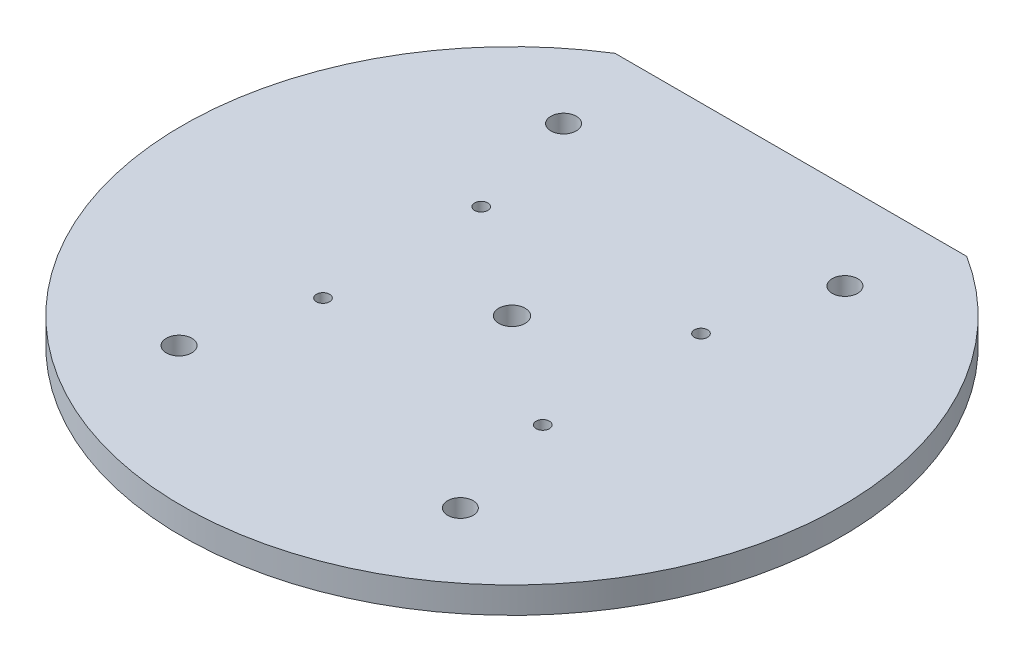
ISO-10303-21;
HEADER;
FILE_DESCRIPTION(('STEP AP214'),'2;1');
FILE_NAME('part.step','',(''),(''),'','','');
FILE_SCHEMA(('AUTOMOTIVE_DESIGN { 1 0 10303 214 1 1 1 1 }'));
ENDSEC;
DATA;
#1=APPLICATION_CONTEXT('core data for automotive mechanical design processes');
#2=APPLICATION_PROTOCOL_DEFINITION('international standard','automotive_design',2000,#1);
#3=PRODUCT_CONTEXT('',#1,'mechanical');
#4=PRODUCT('Part','Part','',(#3));
#5=PRODUCT_RELATED_PRODUCT_CATEGORY('part','',(#4));
#6=PRODUCT_DEFINITION_FORMATION('','',#4);
#7=PRODUCT_DEFINITION_CONTEXT('part definition',#1,'design');
#8=PRODUCT_DEFINITION('design','',#6,#7);
#9=PRODUCT_DEFINITION_SHAPE('','',#8);
#10=(LENGTH_UNIT() NAMED_UNIT(*) SI_UNIT(.MILLI.,.METRE.));
#11=(NAMED_UNIT(*) PLANE_ANGLE_UNIT() SI_UNIT($,.RADIAN.));
#12=(NAMED_UNIT(*) SI_UNIT($,.STERADIAN.) SOLID_ANGLE_UNIT());
#13=UNCERTAINTY_MEASURE_WITH_UNIT(LENGTH_MEASURE(1.E-05),#10,'distance_accuracy_value','');
#14=(GEOMETRIC_REPRESENTATION_CONTEXT(3) GLOBAL_UNCERTAINTY_ASSIGNED_CONTEXT((#13)) GLOBAL_UNIT_ASSIGNED_CONTEXT((#10,
#11,#12)) REPRESENTATION_CONTEXT('',''));
#15=CARTESIAN_POINT('',(0.,0.,0.));
#16=DIRECTION('',(0.,0.,1.));
#17=DIRECTION('',(1.,0.,0.));
#18=AXIS2_PLACEMENT_3D('',#15,#16,#17);
#19=CARTESIAN_POINT('',(0.,6.,0.));
#20=DIRECTION('',(0.,-1.,0.));
#21=DIRECTION('',(0.,0.,-1.));
#22=AXIS2_PLACEMENT_3D('',#19,#20,#21);
#23=CYLINDRICAL_SURFACE('',#22,75.);
#24=CARTESIAN_POINT('',(0.,6.,0.));
#25=DIRECTION('',(0.,1.,0.));
#26=DIRECTION('',(0.,0.,1.));
#27=AXIS2_PLACEMENT_3D('',#24,#25,#26);
#28=CIRCLE('',#27,75.);
#29=CARTESIAN_POINT('',(-40.,6.,-63.4428877022476));
#30=VERTEX_POINT('',#29);
#31=CARTESIAN_POINT('',(40.,6.,-63.4428877022476));
#32=VERTEX_POINT('',#31);
#33=EDGE_CURVE('E11',#30,#32,#28,.T.);
#34=ORIENTED_EDGE('',*,*,#33,.F.);
#35=DIRECTION('',(0.,1.,0.));
#36=VECTOR('',#35,1.);
#37=CARTESIAN_POINT('',(-40.,0.,-63.4428877022476));
#38=LINE('',#37,#36);
#39=CARTESIAN_POINT('',(-40.,0.,-63.4428877022476));
#40=VERTEX_POINT('',#39);
#41=EDGE_CURVE('E59',#40,#30,#38,.T.);
#42=ORIENTED_EDGE('',*,*,#41,.F.);
#43=CARTESIAN_POINT('',(0.,0.,0.));
#44=DIRECTION('',(0.,1.,0.));
#45=DIRECTION('',(0.,0.,1.));
#46=AXIS2_PLACEMENT_3D('',#43,#44,#45);
#47=CIRCLE('',#46,75.);
#48=CARTESIAN_POINT('',(40.,0.,-63.4428877022476));
#49=VERTEX_POINT('',#48);
#50=EDGE_CURVE('E39',#40,#49,#47,.T.);
#51=ORIENTED_EDGE('',*,*,#50,.T.);
#52=DIRECTION('',(0.,1.,0.));
#53=VECTOR('',#52,1.);
#54=CARTESIAN_POINT('',(40.,0.,-63.4428877022476));
#55=LINE('',#54,#53);
#56=EDGE_CURVE('E50',#49,#32,#55,.T.);
#57=ORIENTED_EDGE('',*,*,#56,.T.);
#58=EDGE_LOOP('',(#34,#42,#51,#57));
#59=FACE_BOUND('',#58,.T.);
#60=ADVANCED_FACE('F36',(#59),#23,.T.);
#61=CARTESIAN_POINT('',(0.,6.,0.));
#62=DIRECTION('',(0.,1.,0.));
#63=DIRECTION('',(0.,0.,1.));
#64=AXIS2_PLACEMENT_3D('',#61,#62,#63);
#65=PLANE('',#64);
#66=CARTESIAN_POINT('',(-25.0000000000001,6.,18.));
#67=DIRECTION('',(0.,1.,0.));
#68=DIRECTION('',(0.,0.,1.));
#69=AXIS2_PLACEMENT_3D('',#66,#67,#68);
#70=CIRCLE('',#69,1.49999999999998);
#71=CARTESIAN_POINT('',(-25.0000000000001,6.,19.5));
#72=VERTEX_POINT('',#71);
#73=EDGE_CURVE('E164',#72,#72,#70,.T.);
#74=ORIENTED_EDGE('',*,*,#73,.F.);
#75=EDGE_LOOP('',(#74));
#76=FACE_BOUND('',#75,.T.);
#77=CARTESIAN_POINT('',(-25.,6.,-18.));
#78=DIRECTION('',(0.,1.,0.));
#79=DIRECTION('',(0.,0.,-1.));
#80=AXIS2_PLACEMENT_3D('',#77,#78,#79);
#81=CIRCLE('',#80,1.5);
#82=CARTESIAN_POINT('',(-25.,6.,-19.5));
#83=VERTEX_POINT('',#82);
#84=EDGE_CURVE('E181',#83,#83,#81,.T.);
#85=ORIENTED_EDGE('',*,*,#84,.F.);
#86=EDGE_LOOP('',(#85));
#87=FACE_BOUND('',#86,.T.);
#88=CARTESIAN_POINT('',(25.,6.,-18.));
#89=DIRECTION('',(0.,1.,0.));
#90=DIRECTION('',(0.,0.,1.));
#91=AXIS2_PLACEMENT_3D('',#88,#89,#90);
#92=CIRCLE('',#91,1.5);
#93=CARTESIAN_POINT('',(25.,6.,-16.5));
#94=VERTEX_POINT('',#93);
#95=EDGE_CURVE('E175',#94,#94,#92,.T.);
#96=ORIENTED_EDGE('',*,*,#95,.F.);
#97=EDGE_LOOP('',(#96));
#98=FACE_BOUND('',#97,.T.);
#99=CARTESIAN_POINT('',(31.9999999999999,6.,43.7428877022476));
#100=DIRECTION('',(0.,1.,0.));
#101=DIRECTION('',(0.,0.,1.));
#102=AXIS2_PLACEMENT_3D('',#99,#100,#101);
#103=CIRCLE('',#102,2.9);
#104=CARTESIAN_POINT('',(31.9999999999999,6.,46.6428877022476));
#105=VERTEX_POINT('',#104);
#106=EDGE_CURVE('E169',#105,#105,#103,.T.);
#107=ORIENTED_EDGE('',*,*,#106,.F.);
#108=EDGE_LOOP('',(#107));
#109=FACE_BOUND('',#108,.T.);
#110=CARTESIAN_POINT('',(-32.,6.,43.7428877022476));
#111=DIRECTION('',(0.,1.,0.));
#112=DIRECTION('',(0.,0.,-1.));
#113=AXIS2_PLACEMENT_3D('',#110,#111,#112);
#114=CIRCLE('',#113,2.9);
#115=CARTESIAN_POINT('',(-32.,6.,40.8428877022476));
#116=VERTEX_POINT('',#115);
#117=EDGE_CURVE('E94',#116,#116,#114,.T.);
#118=ORIENTED_EDGE('',*,*,#117,.F.);
#119=EDGE_LOOP('',(#118));
#120=FACE_BOUND('',#119,.T.);
#121=CARTESIAN_POINT('',(0.,6.,0.));
#122=DIRECTION('',(0.,1.,0.));
#123=DIRECTION('',(0.,0.,1.));
#124=AXIS2_PLACEMENT_3D('',#121,#122,#123);
#125=CIRCLE('',#124,3.);
#126=CARTESIAN_POINT('',(0.,6.,3.));
#127=VERTEX_POINT('',#126);
#128=EDGE_CURVE('E88',#127,#127,#125,.T.);
#129=ORIENTED_EDGE('',*,*,#128,.F.);
#130=EDGE_LOOP('',(#129));
#131=FACE_BOUND('',#130,.T.);
#132=CARTESIAN_POINT('',(32.,6.,-43.7428877022476));
#133=DIRECTION('',(0.,1.,0.));
#134=DIRECTION('',(0.,0.,-1.));
#135=AXIS2_PLACEMENT_3D('',#132,#133,#134);
#136=CIRCLE('',#135,2.9);
#137=CARTESIAN_POINT('',(32.,6.,-46.6428877022476));
#138=VERTEX_POINT('',#137);
#139=EDGE_CURVE('E82',#138,#138,#136,.T.);
#140=ORIENTED_EDGE('',*,*,#139,.F.);
#141=EDGE_LOOP('',(#140));
#142=FACE_BOUND('',#141,.T.);
#143=DIRECTION('',(1.,0.,0.));
#144=VECTOR('',#143,1.);
#145=CARTESIAN_POINT('',(-40.,6.,-63.4428877022476));
#146=LINE('',#145,#144);
#147=EDGE_CURVE('E62',#30,#32,#146,.T.);
#148=ORIENTED_EDGE('',*,*,#147,.F.);
#149=ORIENTED_EDGE('',*,*,#33,.T.);
#150=EDGE_LOOP('',(#148,#149));
#151=FACE_BOUND('',#150,.T.);
#152=CARTESIAN_POINT('',(25.,6.,18.));
#153=DIRECTION('',(0.,1.,0.));
#154=DIRECTION('',(0.,0.,-1.));
#155=AXIS2_PLACEMENT_3D('',#152,#153,#154);
#156=CIRCLE('',#155,1.5);
#157=CARTESIAN_POINT('',(25.,6.,16.5));
#158=VERTEX_POINT('',#157);
#159=EDGE_CURVE('E162',#158,#158,#156,.T.);
#160=ORIENTED_EDGE('',*,*,#159,.F.);
#161=EDGE_LOOP('',(#160));
#162=FACE_BOUND('',#161,.T.);
#163=CARTESIAN_POINT('',(-32.,6.,-43.7428877022476));
#164=DIRECTION('',(0.,1.,0.));
#165=DIRECTION('',(0.,0.,1.));
#166=AXIS2_PLACEMENT_3D('',#163,#164,#165);
#167=CIRCLE('',#166,2.9);
#168=CARTESIAN_POINT('',(-32.,6.,-40.8428877022476));
#169=VERTEX_POINT('',#168);
#170=EDGE_CURVE('E73',#169,#169,#167,.T.);
#171=ORIENTED_EDGE('',*,*,#170,.F.);
#172=EDGE_LOOP('',(#171));
#173=FACE_BOUND('',#172,.T.);
#174=ADVANCED_FACE('F69',(#76,#87,#98,#109,#120,#131,#142,#151,#162,#173),#65,.T.);
#175=CARTESIAN_POINT('',(0.,0.,0.));
#176=DIRECTION('',(0.,1.,0.));
#177=DIRECTION('',(0.,0.,1.));
#178=AXIS2_PLACEMENT_3D('',#175,#176,#177);
#179=PLANE('',#178);
#180=CARTESIAN_POINT('',(-25.0000000000001,0.,18.));
#181=DIRECTION('',(0.,1.,0.));
#182=DIRECTION('',(0.,0.,1.));
#183=AXIS2_PLACEMENT_3D('',#180,#181,#182);
#184=CIRCLE('',#183,1.49999999999998);
#185=CARTESIAN_POINT('',(-25.0000000000001,0.,19.5));
#186=VERTEX_POINT('',#185);
#187=EDGE_CURVE('E184',#186,#186,#184,.T.);
#188=ORIENTED_EDGE('',*,*,#187,.T.);
#189=EDGE_LOOP('',(#188));
#190=FACE_BOUND('',#189,.T.);
#191=CARTESIAN_POINT('',(-25.,0.,-18.));
#192=DIRECTION('',(0.,1.,0.));
#193=DIRECTION('',(0.,0.,-1.));
#194=AXIS2_PLACEMENT_3D('',#191,#192,#193);
#195=CIRCLE('',#194,1.5);
#196=CARTESIAN_POINT('',(-25.,0.,-19.5));
#197=VERTEX_POINT('',#196);
#198=EDGE_CURVE('E178',#197,#197,#195,.T.);
#199=ORIENTED_EDGE('',*,*,#198,.T.);
#200=EDGE_LOOP('',(#199));
#201=FACE_BOUND('',#200,.T.);
#202=CARTESIAN_POINT('',(25.,0.,-18.));
#203=DIRECTION('',(0.,1.,0.));
#204=DIRECTION('',(0.,0.,1.));
#205=AXIS2_PLACEMENT_3D('',#202,#203,#204);
#206=CIRCLE('',#205,1.5);
#207=CARTESIAN_POINT('',(25.,0.,-16.5));
#208=VERTEX_POINT('',#207);
#209=EDGE_CURVE('E172',#208,#208,#206,.T.);
#210=ORIENTED_EDGE('',*,*,#209,.T.);
#211=EDGE_LOOP('',(#210));
#212=FACE_BOUND('',#211,.T.);
#213=CARTESIAN_POINT('',(31.9999999999999,0.,43.7428877022476));
#214=DIRECTION('',(0.,1.,0.));
#215=DIRECTION('',(0.,0.,1.));
#216=AXIS2_PLACEMENT_3D('',#213,#214,#215);
#217=CIRCLE('',#216,2.9);
#218=CARTESIAN_POINT('',(31.9999999999999,0.,46.6428877022476));
#219=VERTEX_POINT('',#218);
#220=EDGE_CURVE('E97',#219,#219,#217,.T.);
#221=ORIENTED_EDGE('',*,*,#220,.T.);
#222=EDGE_LOOP('',(#221));
#223=FACE_BOUND('',#222,.T.);
#224=CARTESIAN_POINT('',(-32.,0.,43.7428877022476));
#225=DIRECTION('',(0.,1.,0.));
#226=DIRECTION('',(0.,0.,-1.));
#227=AXIS2_PLACEMENT_3D('',#224,#225,#226);
#228=CIRCLE('',#227,2.9);
#229=CARTESIAN_POINT('',(-32.,0.,40.8428877022476));
#230=VERTEX_POINT('',#229);
#231=EDGE_CURVE('E91',#230,#230,#228,.T.);
#232=ORIENTED_EDGE('',*,*,#231,.T.);
#233=EDGE_LOOP('',(#232));
#234=FACE_BOUND('',#233,.T.);
#235=CARTESIAN_POINT('',(0.,0.,0.));
#236=DIRECTION('',(0.,1.,0.));
#237=DIRECTION('',(0.,0.,1.));
#238=AXIS2_PLACEMENT_3D('',#235,#236,#237);
#239=CIRCLE('',#238,3.);
#240=CARTESIAN_POINT('',(0.,0.,3.));
#241=VERTEX_POINT('',#240);
#242=EDGE_CURVE('E85',#241,#241,#239,.T.);
#243=ORIENTED_EDGE('',*,*,#242,.T.);
#244=EDGE_LOOP('',(#243));
#245=FACE_BOUND('',#244,.T.);
#246=CARTESIAN_POINT('',(32.,0.,-43.7428877022476));
#247=DIRECTION('',(0.,1.,0.));
#248=DIRECTION('',(0.,0.,-1.));
#249=AXIS2_PLACEMENT_3D('',#246,#247,#248);
#250=CIRCLE('',#249,2.9);
#251=CARTESIAN_POINT('',(32.,0.,-46.6428877022476));
#252=VERTEX_POINT('',#251);
#253=EDGE_CURVE('E71',#252,#252,#250,.T.);
#254=ORIENTED_EDGE('',*,*,#253,.T.);
#255=EDGE_LOOP('',(#254));
#256=FACE_BOUND('',#255,.T.);
#257=CARTESIAN_POINT('',(25.,0.,18.));
#258=DIRECTION('',(0.,1.,0.));
#259=DIRECTION('',(0.,0.,-1.));
#260=AXIS2_PLACEMENT_3D('',#257,#258,#259);
#261=CIRCLE('',#260,1.5);
#262=CARTESIAN_POINT('',(25.,0.,16.5));
#263=VERTEX_POINT('',#262);
#264=EDGE_CURVE('E159',#263,#263,#261,.T.);
#265=ORIENTED_EDGE('',*,*,#264,.T.);
#266=EDGE_LOOP('',(#265));
#267=FACE_BOUND('',#266,.T.);
#268=CARTESIAN_POINT('',(-32.,0.,-43.7428877022476));
#269=DIRECTION('',(0.,1.,0.));
#270=DIRECTION('',(0.,0.,1.));
#271=AXIS2_PLACEMENT_3D('',#268,#269,#270);
#272=CIRCLE('',#271,2.9);
#273=CARTESIAN_POINT('',(-32.,0.,-40.8428877022476));
#274=VERTEX_POINT('',#273);
#275=EDGE_CURVE('E76',#274,#274,#272,.T.);
#276=ORIENTED_EDGE('',*,*,#275,.T.);
#277=EDGE_LOOP('',(#276));
#278=FACE_BOUND('',#277,.T.);
#279=ORIENTED_EDGE('',*,*,#50,.F.);
#280=DIRECTION('',(1.,0.,0.));
#281=VECTOR('',#280,1.);
#282=CARTESIAN_POINT('',(-40.,0.,-63.4428877022476));
#283=LINE('',#282,#281);
#284=EDGE_CURVE('E55',#40,#49,#283,.T.);
#285=ORIENTED_EDGE('',*,*,#284,.T.);
#286=EDGE_LOOP('',(#279,#285));
#287=FACE_BOUND('',#286,.T.);
#288=ADVANCED_FACE('F101',(#190,#201,#212,#223,#234,#245,#256,#267,#278,#287),#179,.F.);
#289=CARTESIAN_POINT('',(-32.,0.,-43.7428877022476));
#290=DIRECTION('',(0.,1.,0.));
#291=DIRECTION('',(0.,0.,1.));
#292=AXIS2_PLACEMENT_3D('',#289,#290,#291);
#293=CYLINDRICAL_SURFACE('',#292,2.9);
#294=ORIENTED_EDGE('',*,*,#275,.F.);
#295=EDGE_LOOP('',(#294));
#296=FACE_BOUND('',#295,.T.);
#297=ORIENTED_EDGE('',*,*,#170,.T.);
#298=EDGE_LOOP('',(#297));
#299=FACE_BOUND('',#298,.T.);
#300=ADVANCED_FACE('F104',(#296,#299),#293,.F.);
#301=CARTESIAN_POINT('',(25.,0.,18.));
#302=DIRECTION('',(0.,1.,0.));
#303=DIRECTION('',(0.,0.,1.));
#304=AXIS2_PLACEMENT_3D('',#301,#302,#303);
#305=CYLINDRICAL_SURFACE('',#304,1.5);
#306=ORIENTED_EDGE('',*,*,#264,.F.);
#307=EDGE_LOOP('',(#306));
#308=FACE_BOUND('',#307,.T.);
#309=ORIENTED_EDGE('',*,*,#159,.T.);
#310=EDGE_LOOP('',(#309));
#311=FACE_BOUND('',#310,.T.);
#312=ADVANCED_FACE('F107',(#308,#311),#305,.F.);
#313=CARTESIAN_POINT('',(-40.,0.,-63.4428877022476));
#314=DIRECTION('',(0.,0.,1.));
#315=DIRECTION('',(1.,0.,0.));
#316=AXIS2_PLACEMENT_3D('',#313,#314,#315);
#317=PLANE('',#316);
#318=ORIENTED_EDGE('',*,*,#147,.T.);
#319=ORIENTED_EDGE('',*,*,#56,.F.);
#320=ORIENTED_EDGE('',*,*,#284,.F.);
#321=ORIENTED_EDGE('',*,*,#41,.T.);
#322=EDGE_LOOP('',(#318,#319,#320,#321));
#323=FACE_BOUND('',#322,.T.);
#324=ADVANCED_FACE('F61',(#323),#317,.F.);
#325=CARTESIAN_POINT('',(32.,0.,-43.7428877022476));
#326=DIRECTION('',(0.,1.,0.));
#327=DIRECTION('',(0.,0.,1.));
#328=AXIS2_PLACEMENT_3D('',#325,#326,#327);
#329=CYLINDRICAL_SURFACE('',#328,2.9);
#330=ORIENTED_EDGE('',*,*,#253,.F.);
#331=EDGE_LOOP('',(#330));
#332=FACE_BOUND('',#331,.T.);
#333=ORIENTED_EDGE('',*,*,#139,.T.);
#334=EDGE_LOOP('',(#333));
#335=FACE_BOUND('',#334,.T.);
#336=ADVANCED_FACE('F130',(#332,#335),#329,.F.);
#337=CARTESIAN_POINT('',(0.,0.,0.));
#338=DIRECTION('',(0.,1.,0.));
#339=DIRECTION('',(0.,0.,1.));
#340=AXIS2_PLACEMENT_3D('',#337,#338,#339);
#341=CYLINDRICAL_SURFACE('',#340,3.);
#342=ORIENTED_EDGE('',*,*,#242,.F.);
#343=EDGE_LOOP('',(#342));
#344=FACE_BOUND('',#343,.T.);
#345=ORIENTED_EDGE('',*,*,#128,.T.);
#346=EDGE_LOOP('',(#345));
#347=FACE_BOUND('',#346,.T.);
#348=ADVANCED_FACE('F126',(#344,#347),#341,.F.);
#349=CARTESIAN_POINT('',(-32.,0.,43.7428877022476));
#350=DIRECTION('',(0.,1.,0.));
#351=DIRECTION('',(0.,0.,1.));
#352=AXIS2_PLACEMENT_3D('',#349,#350,#351);
#353=CYLINDRICAL_SURFACE('',#352,2.9);
#354=ORIENTED_EDGE('',*,*,#231,.F.);
#355=EDGE_LOOP('',(#354));
#356=FACE_BOUND('',#355,.T.);
#357=ORIENTED_EDGE('',*,*,#117,.T.);
#358=EDGE_LOOP('',(#357));
#359=FACE_BOUND('',#358,.T.);
#360=ADVANCED_FACE('F122',(#356,#359),#353,.F.);
#361=CARTESIAN_POINT('',(31.9999999999999,0.,43.7428877022476));
#362=DIRECTION('',(0.,1.,0.));
#363=DIRECTION('',(0.,0.,1.));
#364=AXIS2_PLACEMENT_3D('',#361,#362,#363);
#365=CYLINDRICAL_SURFACE('',#364,2.9);
#366=ORIENTED_EDGE('',*,*,#220,.F.);
#367=EDGE_LOOP('',(#366));
#368=FACE_BOUND('',#367,.T.);
#369=ORIENTED_EDGE('',*,*,#106,.T.);
#370=EDGE_LOOP('',(#369));
#371=FACE_BOUND('',#370,.T.);
#372=ADVANCED_FACE('F125',(#368,#371),#365,.F.);
#373=CARTESIAN_POINT('',(25.,0.,-18.));
#374=DIRECTION('',(0.,1.,0.));
#375=DIRECTION('',(0.,0.,1.));
#376=AXIS2_PLACEMENT_3D('',#373,#374,#375);
#377=CYLINDRICAL_SURFACE('',#376,1.5);
#378=ORIENTED_EDGE('',*,*,#209,.F.);
#379=EDGE_LOOP('',(#378));
#380=FACE_BOUND('',#379,.T.);
#381=ORIENTED_EDGE('',*,*,#95,.T.);
#382=EDGE_LOOP('',(#381));
#383=FACE_BOUND('',#382,.T.);
#384=ADVANCED_FACE('F144',(#380,#383),#377,.F.);
#385=CARTESIAN_POINT('',(-25.,0.,-18.));
#386=DIRECTION('',(0.,1.,0.));
#387=DIRECTION('',(0.,0.,1.));
#388=AXIS2_PLACEMENT_3D('',#385,#386,#387);
#389=CYLINDRICAL_SURFACE('',#388,1.5);
#390=ORIENTED_EDGE('',*,*,#198,.F.);
#391=EDGE_LOOP('',(#390));
#392=FACE_BOUND('',#391,.T.);
#393=ORIENTED_EDGE('',*,*,#84,.T.);
#394=EDGE_LOOP('',(#393));
#395=FACE_BOUND('',#394,.T.);
#396=ADVANCED_FACE('F140',(#392,#395),#389,.F.);
#397=CARTESIAN_POINT('',(-25.0000000000001,0.,18.));
#398=DIRECTION('',(0.,1.,0.));
#399=DIRECTION('',(0.,0.,1.));
#400=AXIS2_PLACEMENT_3D('',#397,#398,#399);
#401=CYLINDRICAL_SURFACE('',#400,1.49999999999998);
#402=ORIENTED_EDGE('',*,*,#187,.F.);
#403=EDGE_LOOP('',(#402));
#404=FACE_BOUND('',#403,.T.);
#405=ORIENTED_EDGE('',*,*,#73,.T.);
#406=EDGE_LOOP('',(#405));
#407=FACE_BOUND('',#406,.T.);
#408=ADVANCED_FACE('F137',(#404,#407),#401,.F.);
#409=CLOSED_SHELL('',(#60,#174,#288,#300,#312,#324,#336,#348,#360,#372,#384,#396,#408));
#410=MANIFOLD_SOLID_BREP('B2',#409);
#411=ADVANCED_BREP_SHAPE_REPRESENTATION('',(#18,#410),#14);
#412=SHAPE_DEFINITION_REPRESENTATION(#9,#411);
ENDSEC;
END-ISO-10303-21;
